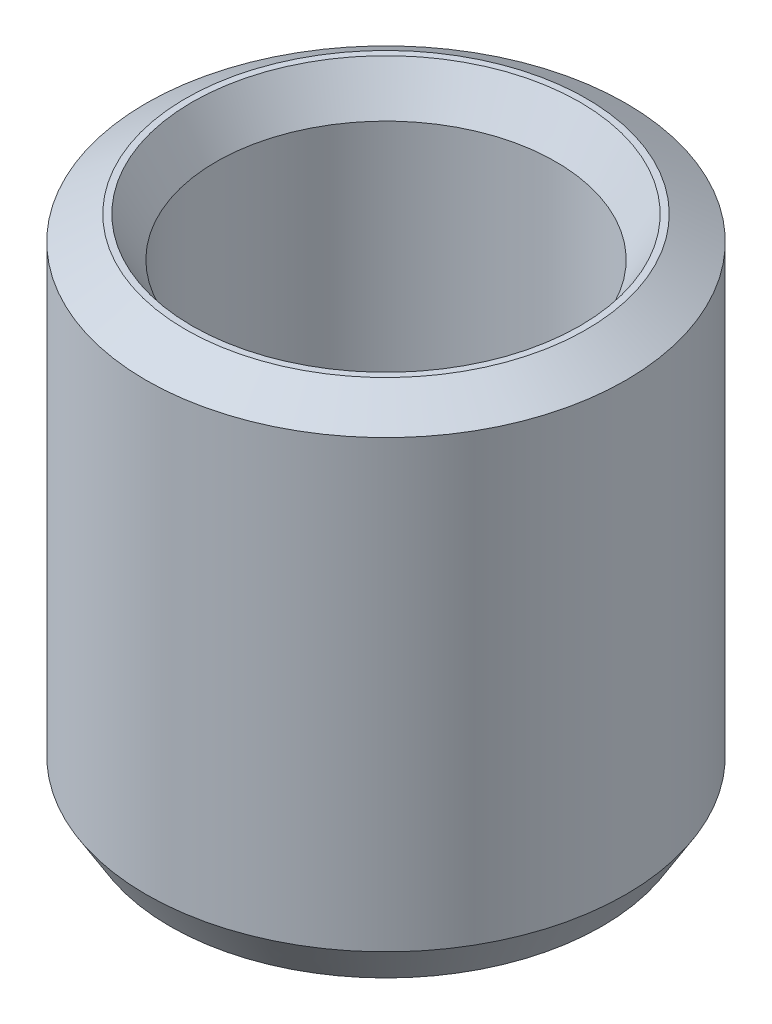
ISO-10303-21;
HEADER;
FILE_DESCRIPTION(('STEP AP214'),'2;1');
FILE_NAME('part.step','',(''),(''),'','','');
FILE_SCHEMA(('AUTOMOTIVE_DESIGN { 1 0 10303 214 1 1 1 1 }'));
ENDSEC;
DATA;
#1=APPLICATION_CONTEXT('core data for automotive mechanical design processes');
#2=APPLICATION_PROTOCOL_DEFINITION('international standard','automotive_design',2000,#1);
#3=PRODUCT_CONTEXT('',#1,'mechanical');
#4=PRODUCT('Part','Part','',(#3));
#5=PRODUCT_RELATED_PRODUCT_CATEGORY('part','',(#4));
#6=PRODUCT_DEFINITION_FORMATION('','',#4);
#7=PRODUCT_DEFINITION_CONTEXT('part definition',#1,'design');
#8=PRODUCT_DEFINITION('design','',#6,#7);
#9=PRODUCT_DEFINITION_SHAPE('','',#8);
#10=(LENGTH_UNIT() NAMED_UNIT(*) SI_UNIT(.MILLI.,.METRE.));
#11=(NAMED_UNIT(*) PLANE_ANGLE_UNIT() SI_UNIT($,.RADIAN.));
#12=(NAMED_UNIT(*) SI_UNIT($,.STERADIAN.) SOLID_ANGLE_UNIT());
#13=UNCERTAINTY_MEASURE_WITH_UNIT(LENGTH_MEASURE(1.E-05),#10,'distance_accuracy_value','');
#14=(GEOMETRIC_REPRESENTATION_CONTEXT(3) GLOBAL_UNCERTAINTY_ASSIGNED_CONTEXT((#13)) GLOBAL_UNIT_ASSIGNED_CONTEXT((#10,
#11,#12)) REPRESENTATION_CONTEXT('',''));
#15=CARTESIAN_POINT('',(0.,0.,0.));
#16=DIRECTION('',(0.,0.,1.));
#17=DIRECTION('',(1.,0.,0.));
#18=AXIS2_PLACEMENT_3D('',#15,#16,#17);
#19=CARTESIAN_POINT('',(0.,74.2543366979306,0.));
#20=DIRECTION('',(0.,-1.,0.));
#21=DIRECTION('',(0.,0.,-1.));
#22=AXIS2_PLACEMENT_3D('',#19,#20,#21);
#23=CYLINDRICAL_SURFACE('',#22,35.);
#24=CARTESIAN_POINT('',(0.,5.77986866650455,0.));
#25=DIRECTION('',(0.,1.,0.));
#26=DIRECTION('',(0.,0.,1.));
#27=AXIS2_PLACEMENT_3D('',#24,#25,#26);
#28=CIRCLE('',#27,35.);
#29=CARTESIAN_POINT('',(0.,5.77986866650455,35.));
#30=VERTEX_POINT('',#29);
#31=EDGE_CURVE('E10',#30,#30,#28,.T.);
#32=ORIENTED_EDGE('',*,*,#31,.T.);
#33=EDGE_LOOP('',(#32));
#34=FACE_BOUND('',#33,.T.);
#35=CARTESIAN_POINT('',(0.,70.7475148217823,0.));
#36=DIRECTION('',(0.,1.,0.));
#37=DIRECTION('',(0.,0.,1.));
#38=AXIS2_PLACEMENT_3D('',#35,#36,#37);
#39=CIRCLE('',#38,35.);
#40=CARTESIAN_POINT('',(0.,70.7475148217823,35.));
#41=VERTEX_POINT('',#40);
#42=EDGE_CURVE('E50',#41,#41,#39,.F.);
#43=ORIENTED_EDGE('',*,*,#42,.T.);
#44=EDGE_LOOP('',(#43));
#45=FACE_BOUND('',#44,.T.);
#46=ADVANCED_FACE('F39',(#34,#45),#23,.T.);
#47=CARTESIAN_POINT('',(0.,74.2543366979306,0.));
#48=DIRECTION('',(0.,1.,0.));
#49=DIRECTION('',(0.,0.,1.));
#50=AXIS2_PLACEMENT_3D('',#47,#48,#49);
#51=PLANE('',#50);
#52=CARTESIAN_POINT('',(0.,74.2543366979306,0.));
#53=DIRECTION('',(0.,1.,0.));
#54=DIRECTION('',(0.,0.,1.));
#55=AXIS2_PLACEMENT_3D('',#52,#53,#54);
#56=CIRCLE('',#55,28.2829986364295);
#57=CARTESIAN_POINT('',(0.,74.2543366979306,28.2829986364295));
#58=VERTEX_POINT('',#57);
#59=EDGE_CURVE('E58',#58,#58,#56,.F.);
#60=ORIENTED_EDGE('',*,*,#59,.T.);
#61=EDGE_LOOP('',(#60));
#62=FACE_BOUND('',#61,.T.);
#63=CARTESIAN_POINT('',(0.,74.2543366979306,0.));
#64=DIRECTION('',(0.,1.,0.));
#65=DIRECTION('',(0.,0.,1.));
#66=AXIS2_PLACEMENT_3D('',#63,#64,#65);
#67=CIRCLE('',#66,29.2201313334955);
#68=CARTESIAN_POINT('',(0.,74.2543366979306,29.2201313334955));
#69=VERTEX_POINT('',#68);
#70=EDGE_CURVE('E61',#69,#69,#67,.T.);
#71=ORIENTED_EDGE('',*,*,#70,.T.);
#72=EDGE_LOOP('',(#71));
#73=FACE_BOUND('',#72,.T.);
#74=ADVANCED_FACE('F88',(#62,#73),#51,.T.);
#75=CARTESIAN_POINT('',(0.,0.,0.));
#76=DIRECTION('',(0.,1.,0.));
#77=DIRECTION('',(0.,0.,1.));
#78=AXIS2_PLACEMENT_3D('',#75,#76,#77);
#79=PLANE('',#78);
#80=CARTESIAN_POINT('',(0.,0.,0.));
#81=DIRECTION('',(0.,1.,0.));
#82=DIRECTION('',(0.,0.,1.));
#83=AXIS2_PLACEMENT_3D('',#80,#81,#82);
#84=CIRCLE('',#83,30.5560454267857);
#85=CARTESIAN_POINT('',(0.,0.,30.5560454267857));
#86=VERTEX_POINT('',#85);
#87=EDGE_CURVE('E51',#86,#86,#84,.T.);
#88=ORIENTED_EDGE('',*,*,#87,.T.);
#89=EDGE_LOOP('',(#88));
#90=FACE_BOUND('',#89,.T.);
#91=CARTESIAN_POINT('',(0.,0.,0.));
#92=DIRECTION('',(0.,1.,0.));
#93=DIRECTION('',(0.,0.,1.));
#94=AXIS2_PLACEMENT_3D('',#91,#92,#93);
#95=CIRCLE('',#94,31.4931781238517);
#96=CARTESIAN_POINT('',(0.,0.,31.4931781238517));
#97=VERTEX_POINT('',#96);
#98=EDGE_CURVE('E54',#97,#97,#95,.F.);
#99=ORIENTED_EDGE('',*,*,#98,.T.);
#100=EDGE_LOOP('',(#99));
#101=FACE_BOUND('',#100,.T.);
#102=ADVANCED_FACE('F83',(#90,#101),#79,.F.);
#103=CARTESIAN_POINT('',(0.,74.2543366979306,0.));
#104=DIRECTION('',(0.,-1.,0.));
#105=DIRECTION('',(0.,0.,-1.));
#106=AXIS2_PLACEMENT_3D('',#103,#104,#105);
#107=CYLINDRICAL_SURFACE('',#106,24.7761767602812);
#108=CARTESIAN_POINT('',(0.,68.4744680314261,0.));
#109=DIRECTION('',(0.,1.,0.));
#110=DIRECTION('',(0.,0.,1.));
#111=AXIS2_PLACEMENT_3D('',#108,#109,#110);
#112=CIRCLE('',#111,24.7761767602812);
#113=CARTESIAN_POINT('',(0.,68.4744680314261,24.7761767602812));
#114=VERTEX_POINT('',#113);
#115=EDGE_CURVE('E67',#114,#114,#112,.T.);
#116=ORIENTED_EDGE('',*,*,#115,.T.);
#117=EDGE_LOOP('',(#116));
#118=FACE_BOUND('',#117,.T.);
#119=CARTESIAN_POINT('',(0.,3.50682187614833,0.));
#120=DIRECTION('',(0.,1.,0.));
#121=DIRECTION('',(0.,0.,1.));
#122=AXIS2_PLACEMENT_3D('',#119,#120,#121);
#123=CIRCLE('',#122,24.7761767602812);
#124=CARTESIAN_POINT('',(0.,3.50682187614833,24.7761767602812));
#125=VERTEX_POINT('',#124);
#126=EDGE_CURVE('E69',#125,#125,#123,.F.);
#127=ORIENTED_EDGE('',*,*,#126,.T.);
#128=EDGE_LOOP('',(#127));
#129=FACE_BOUND('',#128,.T.);
#130=ADVANCED_FACE('F71',(#118,#129),#107,.F.);
#131=CARTESIAN_POINT('',(0.,68.4744680314261,0.));
#132=DIRECTION('',(0.,1.,0.));
#133=DIRECTION('',(0.,0.,1.));
#134=AXIS2_PLACEMENT_3D('',#131,#132,#133);
#135=CONICAL_SURFACE('',#134,24.7761767602812,0.545353613548314);
#136=ORIENTED_EDGE('',*,*,#59,.F.);
#137=EDGE_LOOP('',(#136));
#138=FACE_BOUND('',#137,.T.);
#139=ORIENTED_EDGE('',*,*,#115,.F.);
#140=EDGE_LOOP('',(#139));
#141=FACE_BOUND('',#140,.T.);
#142=ADVANCED_FACE('F77',(#138,#141),#135,.F.);
#143=CARTESIAN_POINT('',(0.,0.,0.));
#144=DIRECTION('',(0.,-1.,0.));
#145=DIRECTION('',(0.,0.,-1.));
#146=AXIS2_PLACEMENT_3D('',#143,#144,#145);
#147=CONICAL_SURFACE('',#146,30.5560454267857,1.02544271324659);
#148=ORIENTED_EDGE('',*,*,#126,.F.);
#149=EDGE_LOOP('',(#148));
#150=FACE_BOUND('',#149,.T.);
#151=ORIENTED_EDGE('',*,*,#87,.F.);
#152=EDGE_LOOP('',(#151));
#153=FACE_BOUND('',#152,.T.);
#154=ADVANCED_FACE('F73',(#150,#153),#147,.F.);
#155=CARTESIAN_POINT('',(0.,5.77986866650455,0.));
#156=DIRECTION('',(0.,1.,0.));
#157=DIRECTION('',(0.,0.,1.));
#158=AXIS2_PLACEMENT_3D('',#155,#156,#157);
#159=CONICAL_SURFACE('',#158,35.,0.545353613548312);
#160=ORIENTED_EDGE('',*,*,#98,.F.);
#161=EDGE_LOOP('',(#160));
#162=FACE_BOUND('',#161,.T.);
#163=ORIENTED_EDGE('',*,*,#31,.F.);
#164=EDGE_LOOP('',(#163));
#165=FACE_BOUND('',#164,.T.);
#166=ADVANCED_FACE('F76',(#162,#165),#159,.T.);
#167=CARTESIAN_POINT('',(0.,74.2543366979306,0.));
#168=DIRECTION('',(0.,-1.,0.));
#169=DIRECTION('',(0.,0.,-1.));
#170=AXIS2_PLACEMENT_3D('',#167,#168,#169);
#171=CONICAL_SURFACE('',#170,29.2201313334955,1.02544271324659);
#172=ORIENTED_EDGE('',*,*,#42,.F.);
#173=EDGE_LOOP('',(#172));
#174=FACE_BOUND('',#173,.T.);
#175=ORIENTED_EDGE('',*,*,#70,.F.);
#176=EDGE_LOOP('',(#175));
#177=FACE_BOUND('',#176,.T.);
#178=ADVANCED_FACE('F45',(#174,#177),#171,.T.);
#179=CLOSED_SHELL('',(#46,#74,#102,#130,#142,#154,#166,#178));
#180=MANIFOLD_SOLID_BREP('B2',#179);
#181=ADVANCED_BREP_SHAPE_REPRESENTATION('',(#18,#180),#14);
#182=SHAPE_DEFINITION_REPRESENTATION(#9,#181);
ENDSEC;
END-ISO-10303-21;
